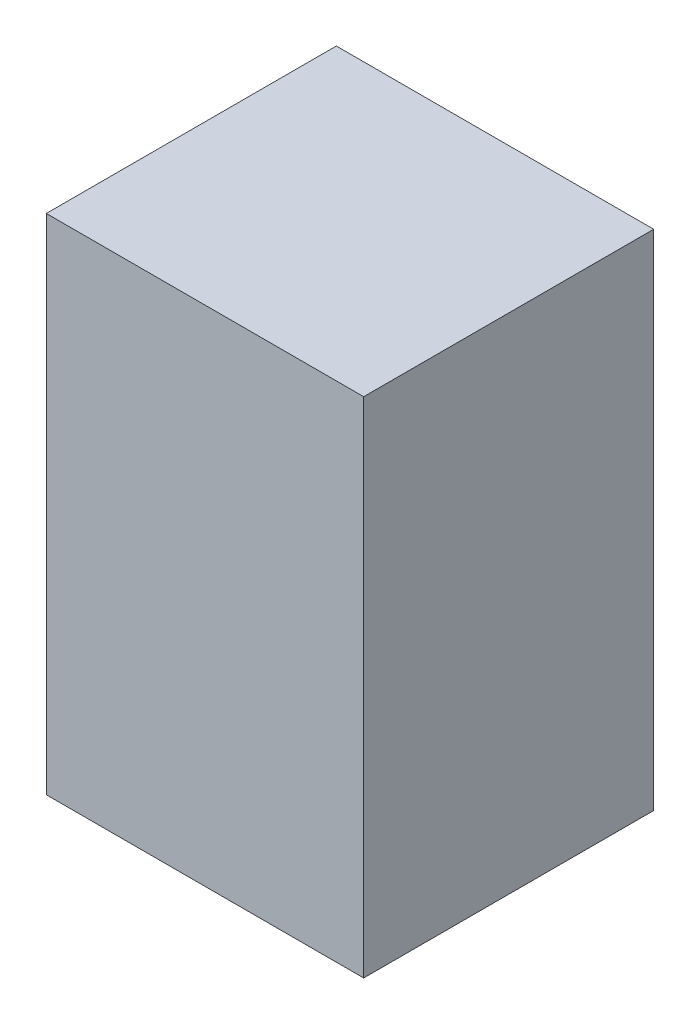
ISO-10303-21;
HEADER;
FILE_DESCRIPTION(('STEP AP214'),'2;1');
FILE_NAME('part.step','',(''),(''),'','','');
FILE_SCHEMA(('AUTOMOTIVE_DESIGN { 1 0 10303 214 1 1 1 1 }'));
ENDSEC;
DATA;
#1=APPLICATION_CONTEXT('core data for automotive mechanical design processes');
#2=APPLICATION_PROTOCOL_DEFINITION('international standard','automotive_design',2000,#1);
#3=PRODUCT_CONTEXT('',#1,'mechanical');
#4=PRODUCT('Part','Part','',(#3));
#5=PRODUCT_RELATED_PRODUCT_CATEGORY('part','',(#4));
#6=PRODUCT_DEFINITION_FORMATION('','',#4);
#7=PRODUCT_DEFINITION_CONTEXT('part definition',#1,'design');
#8=PRODUCT_DEFINITION('design','',#6,#7);
#9=PRODUCT_DEFINITION_SHAPE('','',#8);
#10=(LENGTH_UNIT() NAMED_UNIT(*) SI_UNIT(.MILLI.,.METRE.));
#11=(NAMED_UNIT(*) PLANE_ANGLE_UNIT() SI_UNIT($,.RADIAN.));
#12=(NAMED_UNIT(*) SI_UNIT($,.STERADIAN.) SOLID_ANGLE_UNIT());
#13=UNCERTAINTY_MEASURE_WITH_UNIT(LENGTH_MEASURE(1.E-05),#10,'distance_accuracy_value','');
#14=(GEOMETRIC_REPRESENTATION_CONTEXT(3) GLOBAL_UNCERTAINTY_ASSIGNED_CONTEXT((#13)) GLOBAL_UNIT_ASSIGNED_CONTEXT((#10,
#11,#12)) REPRESENTATION_CONTEXT('',''));
#15=CARTESIAN_POINT('',(0.,0.,0.));
#16=DIRECTION('',(0.,0.,1.));
#17=DIRECTION('',(1.,0.,0.));
#18=AXIS2_PLACEMENT_3D('',#15,#16,#17);
#19=CARTESIAN_POINT('',(1.44999964,-2.30000048,2.64999978));
#20=DIRECTION('',(0.,0.,1.));
#21=DIRECTION('',(1.,0.,0.));
#22=AXIS2_PLACEMENT_3D('',#19,#20,#21);
#23=PLANE('',#22);
#24=DIRECTION('',(0.,-1.,0.));
#25=VECTOR('',#24,1.);
#26=CARTESIAN_POINT('',(1.44999964,2.30000048,2.64999978));
#27=LINE('',#26,#25);
#28=CARTESIAN_POINT('',(1.44999964,2.30000048,2.64999978));
#29=VERTEX_POINT('',#28);
#30=CARTESIAN_POINT('',(1.44999964,-2.30000048,2.64999978));
#31=VERTEX_POINT('',#30);
#32=EDGE_CURVE('E20',#29,#31,#27,.T.);
#33=ORIENTED_EDGE('',*,*,#32,.F.);
#34=DIRECTION('',(1.,0.,0.));
#35=VECTOR('',#34,1.);
#36=CARTESIAN_POINT('',(-1.44999964,2.30000048,2.64999978));
#37=LINE('',#36,#35);
#38=CARTESIAN_POINT('',(-1.44999964,2.30000048,2.64999978));
#39=VERTEX_POINT('',#38);
#40=EDGE_CURVE('E68',#39,#29,#37,.T.);
#41=ORIENTED_EDGE('',*,*,#40,.F.);
#42=DIRECTION('',(0.,1.,0.));
#43=VECTOR('',#42,1.);
#44=CARTESIAN_POINT('',(-1.44999964,-2.30000048,2.64999978));
#45=LINE('',#44,#43);
#46=CARTESIAN_POINT('',(-1.44999964,-2.30000048,2.64999978));
#47=VERTEX_POINT('',#46);
#48=EDGE_CURVE('E71',#47,#39,#45,.T.);
#49=ORIENTED_EDGE('',*,*,#48,.F.);
#50=DIRECTION('',(-1.,0.,0.));
#51=VECTOR('',#50,1.);
#52=CARTESIAN_POINT('',(1.44999964,-2.30000048,2.64999978));
#53=LINE('',#52,#51);
#54=EDGE_CURVE('E114',#31,#47,#53,.T.);
#55=ORIENTED_EDGE('',*,*,#54,.F.);
#56=EDGE_LOOP('',(#33,#41,#49,#55));
#57=FACE_BOUND('',#56,.T.);
#58=ADVANCED_FACE('F17',(#57),#23,.T.);
#59=CARTESIAN_POINT('',(1.44999964,-2.30000048,0.));
#60=DIRECTION('',(0.,0.,1.));
#61=DIRECTION('',(1.,0.,0.));
#62=AXIS2_PLACEMENT_3D('',#59,#60,#61);
#63=PLANE('',#62);
#64=DIRECTION('',(-1.,0.,0.));
#65=VECTOR('',#64,1.);
#66=CARTESIAN_POINT('',(1.44999964,-2.30000048,0.));
#67=LINE('',#66,#65);
#68=CARTESIAN_POINT('',(1.44999964,-2.30000048,0.));
#69=VERTEX_POINT('',#68);
#70=CARTESIAN_POINT('',(-1.44999964,-2.30000048,0.));
#71=VERTEX_POINT('',#70);
#72=EDGE_CURVE('E92',#69,#71,#67,.T.);
#73=ORIENTED_EDGE('',*,*,#72,.T.);
#74=DIRECTION('',(0.,1.,0.));
#75=VECTOR('',#74,1.);
#76=CARTESIAN_POINT('',(-1.44999964,-2.30000048,0.));
#77=LINE('',#76,#75);
#78=CARTESIAN_POINT('',(-1.44999964,2.30000048,0.));
#79=VERTEX_POINT('',#78);
#80=EDGE_CURVE('E77',#71,#79,#77,.T.);
#81=ORIENTED_EDGE('',*,*,#80,.T.);
#82=DIRECTION('',(1.,0.,0.));
#83=VECTOR('',#82,1.);
#84=CARTESIAN_POINT('',(-1.44999964,2.30000048,0.));
#85=LINE('',#84,#83);
#86=CARTESIAN_POINT('',(1.44999964,2.30000048,0.));
#87=VERTEX_POINT('',#86);
#88=EDGE_CURVE('E82',#79,#87,#85,.T.);
#89=ORIENTED_EDGE('',*,*,#88,.T.);
#90=DIRECTION('',(0.,-1.,0.));
#91=VECTOR('',#90,1.);
#92=CARTESIAN_POINT('',(1.44999964,2.30000048,0.));
#93=LINE('',#92,#91);
#94=EDGE_CURVE('E11',#87,#69,#93,.T.);
#95=ORIENTED_EDGE('',*,*,#94,.T.);
#96=EDGE_LOOP('',(#73,#81,#89,#95));
#97=FACE_BOUND('',#96,.T.);
#98=ADVANCED_FACE('F181',(#97),#63,.F.);
#99=CARTESIAN_POINT('',(1.44999964,2.30000048,0.));
#100=DIRECTION('',(1.,0.,0.));
#101=DIRECTION('',(0.,1.,0.));
#102=AXIS2_PLACEMENT_3D('',#99,#100,#101);
#103=PLANE('',#102);
#104=DIRECTION('',(0.,0.,1.));
#105=VECTOR('',#104,1.);
#106=CARTESIAN_POINT('',(1.44999964,2.30000048,0.));
#107=LINE('',#106,#105);
#108=EDGE_CURVE('E76',#87,#29,#107,.T.);
#109=ORIENTED_EDGE('',*,*,#108,.T.);
#110=ORIENTED_EDGE('',*,*,#32,.T.);
#111=DIRECTION('',(0.,0.,1.));
#112=VECTOR('',#111,1.);
#113=CARTESIAN_POINT('',(1.44999964,-2.30000048,0.));
#114=LINE('',#113,#112);
#115=EDGE_CURVE('E110',#69,#31,#114,.T.);
#116=ORIENTED_EDGE('',*,*,#115,.F.);
#117=ORIENTED_EDGE('',*,*,#94,.F.);
#118=EDGE_LOOP('',(#109,#110,#116,#117));
#119=FACE_BOUND('',#118,.T.);
#120=ADVANCED_FACE('F173',(#119),#103,.T.);
#121=CARTESIAN_POINT('',(-1.44999964,2.30000048,0.));
#122=DIRECTION('',(0.,1.,0.));
#123=DIRECTION('',(1.,0.,0.));
#124=AXIS2_PLACEMENT_3D('',#121,#122,#123);
#125=PLANE('',#124);
#126=DIRECTION('',(0.,0.,1.));
#127=VECTOR('',#126,1.);
#128=CARTESIAN_POINT('',(-1.44999964,2.30000048,0.));
#129=LINE('',#128,#127);
#130=EDGE_CURVE('E80',#79,#39,#129,.T.);
#131=ORIENTED_EDGE('',*,*,#130,.T.);
#132=ORIENTED_EDGE('',*,*,#40,.T.);
#133=ORIENTED_EDGE('',*,*,#108,.F.);
#134=ORIENTED_EDGE('',*,*,#88,.F.);
#135=EDGE_LOOP('',(#131,#132,#133,#134));
#136=FACE_BOUND('',#135,.T.);
#137=ADVANCED_FACE('F81',(#136),#125,.T.);
#138=CARTESIAN_POINT('',(-1.44999964,-2.30000048,0.));
#139=DIRECTION('',(-1.,0.,0.));
#140=DIRECTION('',(0.,0.,1.));
#141=AXIS2_PLACEMENT_3D('',#138,#139,#140);
#142=PLANE('',#141);
#143=DIRECTION('',(0.,0.,1.));
#144=VECTOR('',#143,1.);
#145=CARTESIAN_POINT('',(-1.44999964,-2.30000048,0.));
#146=LINE('',#145,#144);
#147=EDGE_CURVE('E89',#71,#47,#146,.T.);
#148=ORIENTED_EDGE('',*,*,#147,.T.);
#149=ORIENTED_EDGE('',*,*,#48,.T.);
#150=ORIENTED_EDGE('',*,*,#130,.F.);
#151=ORIENTED_EDGE('',*,*,#80,.F.);
#152=EDGE_LOOP('',(#148,#149,#150,#151));
#153=FACE_BOUND('',#152,.T.);
#154=ADVANCED_FACE('F87',(#153),#142,.T.);
#155=CARTESIAN_POINT('',(1.44999964,-2.30000048,0.));
#156=DIRECTION('',(0.,-1.,0.));
#157=DIRECTION('',(0.,0.,-1.));
#158=AXIS2_PLACEMENT_3D('',#155,#156,#157);
#159=PLANE('',#158);
#160=ORIENTED_EDGE('',*,*,#115,.T.);
#161=ORIENTED_EDGE('',*,*,#54,.T.);
#162=ORIENTED_EDGE('',*,*,#147,.F.);
#163=ORIENTED_EDGE('',*,*,#72,.F.);
#164=EDGE_LOOP('',(#160,#161,#162,#163));
#165=FACE_BOUND('',#164,.T.);
#166=ADVANCED_FACE('F153',(#165),#159,.T.);
#167=CLOSED_SHELL('',(#58,#98,#120,#137,#154,#166));
#168=MANIFOLD_SOLID_BREP('B1',#167);
#169=ADVANCED_BREP_SHAPE_REPRESENTATION('',(#18,#168),#14);
#170=SHAPE_DEFINITION_REPRESENTATION(#9,#169);
ENDSEC;
END-ISO-10303-21;
